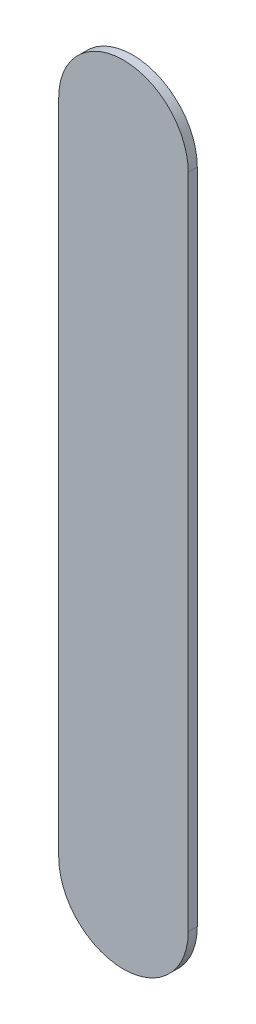
ISO-10303-21;
HEADER;
FILE_DESCRIPTION(('STEP AP214'),'2;1');
FILE_NAME('part.step','',(''),(''),'','','');
FILE_SCHEMA(('AUTOMOTIVE_DESIGN { 1 0 10303 214 1 1 1 1 }'));
ENDSEC;
DATA;
#1=APPLICATION_CONTEXT('core data for automotive mechanical design processes');
#2=APPLICATION_PROTOCOL_DEFINITION('international standard','automotive_design',2000,#1);
#3=PRODUCT_CONTEXT('',#1,'mechanical');
#4=PRODUCT('Part','Part','',(#3));
#5=PRODUCT_RELATED_PRODUCT_CATEGORY('part','',(#4));
#6=PRODUCT_DEFINITION_FORMATION('','',#4);
#7=PRODUCT_DEFINITION_CONTEXT('part definition',#1,'design');
#8=PRODUCT_DEFINITION('design','',#6,#7);
#9=PRODUCT_DEFINITION_SHAPE('','',#8);
#10=(LENGTH_UNIT() NAMED_UNIT(*) SI_UNIT(.MILLI.,.METRE.));
#11=(NAMED_UNIT(*) PLANE_ANGLE_UNIT() SI_UNIT($,.RADIAN.));
#12=(NAMED_UNIT(*) SI_UNIT($,.STERADIAN.) SOLID_ANGLE_UNIT());
#13=UNCERTAINTY_MEASURE_WITH_UNIT(LENGTH_MEASURE(1.E-05),#10,'distance_accuracy_value','');
#14=(GEOMETRIC_REPRESENTATION_CONTEXT(3) GLOBAL_UNCERTAINTY_ASSIGNED_CONTEXT((#13)) GLOBAL_UNIT_ASSIGNED_CONTEXT((#10,
#11,#12)) REPRESENTATION_CONTEXT('',''));
#15=CARTESIAN_POINT('',(0.,0.,0.));
#16=DIRECTION('',(0.,0.,1.));
#17=DIRECTION('',(1.,0.,0.));
#18=AXIS2_PLACEMENT_3D('',#15,#16,#17);
#19=CARTESIAN_POINT('',(168.152,-145.034,0.));
#20=DIRECTION('',(0.,0.,1.));
#21=DIRECTION('',(1.,0.,0.));
#22=AXIS2_PLACEMENT_3D('',#19,#20,#21);
#23=PLANE('',#22);
#24=DIRECTION('',(0.,-1.,0.));
#25=VECTOR('',#24,1.);
#26=CARTESIAN_POINT('',(168.152,-145.034,0.));
#27=LINE('',#26,#25);
#28=CARTESIAN_POINT('',(168.152,-145.034,0.));
#29=VERTEX_POINT('',#28);
#30=CARTESIAN_POINT('',(168.152,-147.574,0.));
#31=VERTEX_POINT('',#30);
#32=EDGE_CURVE('E82',#29,#31,#27,.T.);
#33=ORIENTED_EDGE('',*,*,#32,.T.);
#34=CARTESIAN_POINT('',(168.402,-147.574,0.));
#35=DIRECTION('',(0.,0.,1.));
#36=DIRECTION('',(-1.,0.,0.));
#37=AXIS2_PLACEMENT_3D('',#34,#35,#36);
#38=CIRCLE('',#37,0.25);
#39=CARTESIAN_POINT('',(168.652,-147.574,0.));
#40=VERTEX_POINT('',#39);
#41=EDGE_CURVE('E101',#31,#40,#38,.T.);
#42=ORIENTED_EDGE('',*,*,#41,.T.);
#43=DIRECTION('',(0.,1.,0.));
#44=VECTOR('',#43,1.);
#45=CARTESIAN_POINT('',(168.652,-147.574,0.));
#46=LINE('',#45,#44);
#47=CARTESIAN_POINT('',(168.652,-145.034,0.));
#48=VERTEX_POINT('',#47);
#49=EDGE_CURVE('E75',#40,#48,#46,.T.);
#50=ORIENTED_EDGE('',*,*,#49,.T.);
#51=CARTESIAN_POINT('',(168.402,-145.034,0.));
#52=DIRECTION('',(0.,0.,1.));
#53=DIRECTION('',(1.,0.,0.));
#54=AXIS2_PLACEMENT_3D('',#51,#52,#53);
#55=CIRCLE('',#54,0.25);
#56=EDGE_CURVE('E11',#48,#29,#55,.T.);
#57=ORIENTED_EDGE('',*,*,#56,.T.);
#58=EDGE_LOOP('',(#33,#42,#50,#57));
#59=FACE_BOUND('',#58,.T.);
#60=ADVANCED_FACE('F17',(#59),#23,.T.);
#61=CARTESIAN_POINT('',(168.152,-145.034,-0.035));
#62=DIRECTION('',(0.,0.,1.));
#63=DIRECTION('',(1.,0.,0.));
#64=AXIS2_PLACEMENT_3D('',#61,#62,#63);
#65=PLANE('',#64);
#66=CARTESIAN_POINT('',(168.402,-145.034,-0.035));
#67=DIRECTION('',(0.,0.,1.));
#68=DIRECTION('',(1.,0.,0.));
#69=AXIS2_PLACEMENT_3D('',#66,#67,#68);
#70=CIRCLE('',#69,0.25);
#71=CARTESIAN_POINT('',(168.652,-145.034,-0.035));
#72=VERTEX_POINT('',#71);
#73=CARTESIAN_POINT('',(168.152,-145.034,-0.035));
#74=VERTEX_POINT('',#73);
#75=EDGE_CURVE('E20',#72,#74,#70,.T.);
#76=ORIENTED_EDGE('',*,*,#75,.F.);
#77=DIRECTION('',(0.,1.,0.));
#78=VECTOR('',#77,1.);
#79=CARTESIAN_POINT('',(168.652,-147.574,-0.035));
#80=LINE('',#79,#78);
#81=CARTESIAN_POINT('',(168.652,-147.574,-0.035));
#82=VERTEX_POINT('',#81);
#83=EDGE_CURVE('E112',#82,#72,#80,.T.);
#84=ORIENTED_EDGE('',*,*,#83,.F.);
#85=CARTESIAN_POINT('',(168.402,-147.574,-0.035));
#86=DIRECTION('',(0.,0.,1.));
#87=DIRECTION('',(-1.,0.,0.));
#88=AXIS2_PLACEMENT_3D('',#85,#86,#87);
#89=CIRCLE('',#88,0.25);
#90=CARTESIAN_POINT('',(168.152,-147.574,-0.035));
#91=VERTEX_POINT('',#90);
#92=EDGE_CURVE('E84',#91,#82,#89,.T.);
#93=ORIENTED_EDGE('',*,*,#92,.F.);
#94=DIRECTION('',(0.,-1.,0.));
#95=VECTOR('',#94,1.);
#96=CARTESIAN_POINT('',(168.152,-145.034,-0.035));
#97=LINE('',#96,#95);
#98=EDGE_CURVE('E80',#74,#91,#97,.T.);
#99=ORIENTED_EDGE('',*,*,#98,.F.);
#100=EDGE_LOOP('',(#76,#84,#93,#99));
#101=FACE_BOUND('',#100,.T.);
#102=ADVANCED_FACE('F86',(#101),#65,.F.);
#103=CARTESIAN_POINT('',(168.402,-145.034,-0.035));
#104=DIRECTION('',(0.,0.,-1.));
#105=DIRECTION('',(1.,0.,0.));
#106=AXIS2_PLACEMENT_3D('',#103,#104,#105);
#107=CYLINDRICAL_SURFACE('',#106,0.25);
#108=ORIENTED_EDGE('',*,*,#75,.T.);
#109=DIRECTION('',(0.,0.,1.));
#110=VECTOR('',#109,1.);
#111=CARTESIAN_POINT('',(168.152,-145.034,-0.035));
#112=LINE('',#111,#110);
#113=EDGE_CURVE('E69',#74,#29,#112,.T.);
#114=ORIENTED_EDGE('',*,*,#113,.T.);
#115=ORIENTED_EDGE('',*,*,#56,.F.);
#116=DIRECTION('',(0.,0.,1.));
#117=VECTOR('',#116,1.);
#118=CARTESIAN_POINT('',(168.652,-145.034,-0.035));
#119=LINE('',#118,#117);
#120=EDGE_CURVE('E72',#72,#48,#119,.T.);
#121=ORIENTED_EDGE('',*,*,#120,.F.);
#122=EDGE_LOOP('',(#108,#114,#115,#121));
#123=FACE_BOUND('',#122,.T.);
#124=ADVANCED_FACE('F68',(#123),#107,.T.);
#125=CARTESIAN_POINT('',(168.652,-147.574,-0.035));
#126=DIRECTION('',(-1.,0.,0.));
#127=DIRECTION('',(0.,0.,1.));
#128=AXIS2_PLACEMENT_3D('',#125,#126,#127);
#129=PLANE('',#128);
#130=ORIENTED_EDGE('',*,*,#83,.T.);
#131=ORIENTED_EDGE('',*,*,#120,.T.);
#132=ORIENTED_EDGE('',*,*,#49,.F.);
#133=DIRECTION('',(0.,0.,1.));
#134=VECTOR('',#133,1.);
#135=CARTESIAN_POINT('',(168.652,-147.574,-0.035));
#136=LINE('',#135,#134);
#137=EDGE_CURVE('E98',#82,#40,#136,.T.);
#138=ORIENTED_EDGE('',*,*,#137,.F.);
#139=EDGE_LOOP('',(#130,#131,#132,#138));
#140=FACE_BOUND('',#139,.T.);
#141=ADVANCED_FACE('F119',(#140),#129,.F.);
#142=CARTESIAN_POINT('',(168.402,-147.574,-0.035));
#143=DIRECTION('',(0.,0.,-1.));
#144=DIRECTION('',(-1.,0.,0.));
#145=AXIS2_PLACEMENT_3D('',#142,#143,#144);
#146=CYLINDRICAL_SURFACE('',#145,0.25);
#147=ORIENTED_EDGE('',*,*,#92,.T.);
#148=ORIENTED_EDGE('',*,*,#137,.T.);
#149=ORIENTED_EDGE('',*,*,#41,.F.);
#150=DIRECTION('',(0.,0.,1.));
#151=VECTOR('',#150,1.);
#152=CARTESIAN_POINT('',(168.152,-147.574,-0.035));
#153=LINE('',#152,#151);
#154=EDGE_CURVE('E90',#91,#31,#153,.T.);
#155=ORIENTED_EDGE('',*,*,#154,.F.);
#156=EDGE_LOOP('',(#147,#148,#149,#155));
#157=FACE_BOUND('',#156,.T.);
#158=ADVANCED_FACE('F121',(#157),#146,.T.);
#159=CARTESIAN_POINT('',(168.152,-145.034,-0.035));
#160=DIRECTION('',(1.,0.,0.));
#161=DIRECTION('',(0.,1.,0.));
#162=AXIS2_PLACEMENT_3D('',#159,#160,#161);
#163=PLANE('',#162);
#164=ORIENTED_EDGE('',*,*,#98,.T.);
#165=ORIENTED_EDGE('',*,*,#154,.T.);
#166=ORIENTED_EDGE('',*,*,#32,.F.);
#167=ORIENTED_EDGE('',*,*,#113,.F.);
#168=EDGE_LOOP('',(#164,#165,#166,#167));
#169=FACE_BOUND('',#168,.T.);
#170=ADVANCED_FACE('F78',(#169),#163,.F.);
#171=CLOSED_SHELL('',(#60,#102,#124,#141,#158,#170));
#172=MANIFOLD_SOLID_BREP('B1',#171);
#173=ADVANCED_BREP_SHAPE_REPRESENTATION('',(#18,#172),#14);
#174=SHAPE_DEFINITION_REPRESENTATION(#9,#173);
ENDSEC;
END-ISO-10303-21;
